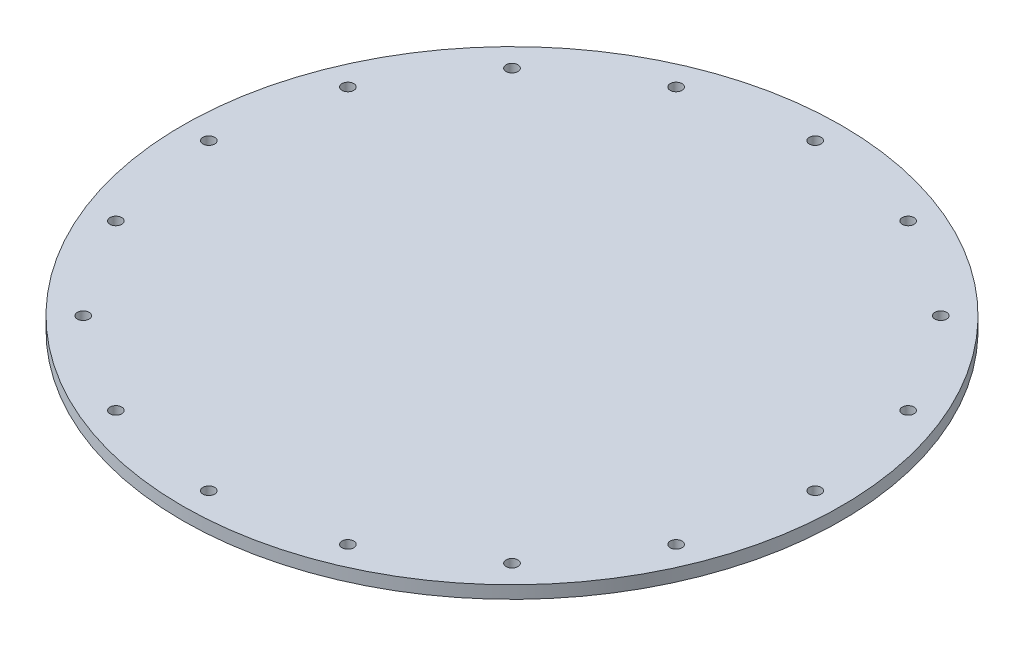
ISO-10303-21;
HEADER;
FILE_DESCRIPTION(('STEP AP214'),'2;1');
FILE_NAME('part.step','',(''),(''),'','','');
FILE_SCHEMA(('AUTOMOTIVE_DESIGN { 1 0 10303 214 1 1 1 1 }'));
ENDSEC;
DATA;
#1=APPLICATION_CONTEXT('core data for automotive mechanical design processes');
#2=APPLICATION_PROTOCOL_DEFINITION('international standard','automotive_design',2000,#1);
#3=PRODUCT_CONTEXT('',#1,'mechanical');
#4=PRODUCT('Part','Part','',(#3));
#5=PRODUCT_RELATED_PRODUCT_CATEGORY('part','',(#4));
#6=PRODUCT_DEFINITION_FORMATION('','',#4);
#7=PRODUCT_DEFINITION_CONTEXT('part definition',#1,'design');
#8=PRODUCT_DEFINITION('design','',#6,#7);
#9=PRODUCT_DEFINITION_SHAPE('','',#8);
#10=(LENGTH_UNIT() NAMED_UNIT(*) SI_UNIT(.MILLI.,.METRE.));
#11=(NAMED_UNIT(*) PLANE_ANGLE_UNIT() SI_UNIT($,.RADIAN.));
#12=(NAMED_UNIT(*) SI_UNIT($,.STERADIAN.) SOLID_ANGLE_UNIT());
#13=UNCERTAINTY_MEASURE_WITH_UNIT(LENGTH_MEASURE(1.E-05),#10,'distance_accuracy_value','');
#14=(GEOMETRIC_REPRESENTATION_CONTEXT(3) GLOBAL_UNCERTAINTY_ASSIGNED_CONTEXT((#13)) GLOBAL_UNIT_ASSIGNED_CONTEXT((#10,
#11,#12)) REPRESENTATION_CONTEXT('',''));
#15=CARTESIAN_POINT('',(0.,0.,0.));
#16=DIRECTION('',(0.,0.,1.));
#17=DIRECTION('',(1.,0.,0.));
#18=AXIS2_PLACEMENT_3D('',#15,#16,#17);
#19=CARTESIAN_POINT('',(0.,3.048,0.));
#20=DIRECTION('',(0.,1.,0.));
#21=DIRECTION('',(0.,0.,1.));
#22=AXIS2_PLACEMENT_3D('',#19,#20,#21);
#23=PLANE('',#22);
#24=CARTESIAN_POINT('',(-51.6364726961476,3.048,-51.6364726961476));
#25=DIRECTION('',(0.,1.,0.));
#26=DIRECTION('',(0.,0.,1.));
#27=AXIS2_PLACEMENT_3D('',#24,#25,#26);
#28=CIRCLE('',#27,1.42240000000086);
#29=CARTESIAN_POINT('',(-51.6364726961476,3.048,-50.2140726961468));
#30=VERTEX_POINT('',#29);
#31=EDGE_CURVE('E124',#30,#30,#28,.T.);
#32=ORIENTED_EDGE('',*,*,#31,.F.);
#33=EDGE_LOOP('',(#32));
#34=FACE_BOUND('',#33,.T.);
#35=CARTESIAN_POINT('',(-73.025,3.048,0.));
#36=DIRECTION('',(0.,1.,0.));
#37=DIRECTION('',(0.,0.,1.));
#38=AXIS2_PLACEMENT_3D('',#35,#36,#37);
#39=CIRCLE('',#38,1.42240000000075);
#40=CARTESIAN_POINT('',(-73.025,3.048,1.42240000000076));
#41=VERTEX_POINT('',#40);
#42=EDGE_CURVE('E112',#41,#41,#39,.T.);
#43=ORIENTED_EDGE('',*,*,#42,.F.);
#44=EDGE_LOOP('',(#43));
#45=FACE_BOUND('',#44,.T.);
#46=CARTESIAN_POINT('',(-51.6364726961476,3.048,51.6364726961476));
#47=DIRECTION('',(0.,1.,0.));
#48=DIRECTION('',(0.,0.,1.));
#49=AXIS2_PLACEMENT_3D('',#46,#47,#48);
#50=CIRCLE('',#49,1.42240000000064);
#51=CARTESIAN_POINT('',(-51.6364726961476,3.048,53.0588726961483));
#52=VERTEX_POINT('',#51);
#53=EDGE_CURVE('E100',#52,#52,#50,.T.);
#54=ORIENTED_EDGE('',*,*,#53,.F.);
#55=EDGE_LOOP('',(#54));
#56=FACE_BOUND('',#55,.T.);
#57=CARTESIAN_POINT('',(0.,3.048,73.025));
#58=DIRECTION('',(0.,1.,0.));
#59=DIRECTION('',(0.,0.,1.));
#60=AXIS2_PLACEMENT_3D('',#57,#58,#59);
#61=CIRCLE('',#60,1.4224000000005);
#62=CARTESIAN_POINT('',(0.,3.048,74.4474000000005));
#63=VERTEX_POINT('',#62);
#64=EDGE_CURVE('E88',#63,#63,#61,.T.);
#65=ORIENTED_EDGE('',*,*,#64,.F.);
#66=EDGE_LOOP('',(#65));
#67=FACE_BOUND('',#66,.T.);
#68=CARTESIAN_POINT('',(51.6364726961476,3.048,51.6364726961476));
#69=DIRECTION('',(0.,1.,0.));
#70=DIRECTION('',(0.,0.,1.));
#71=AXIS2_PLACEMENT_3D('',#68,#69,#70);
#72=CIRCLE('',#71,1.42240000000036);
#73=CARTESIAN_POINT('',(51.6364726961476,3.048,53.058872696148));
#74=VERTEX_POINT('',#73);
#75=EDGE_CURVE('E76',#74,#74,#72,.T.);
#76=ORIENTED_EDGE('',*,*,#75,.F.);
#77=EDGE_LOOP('',(#76));
#78=FACE_BOUND('',#77,.T.);
#79=CARTESIAN_POINT('',(73.025,3.048,0.));
#80=DIRECTION('',(0.,1.,0.));
#81=DIRECTION('',(0.,0.,1.));
#82=AXIS2_PLACEMENT_3D('',#79,#80,#81);
#83=CIRCLE('',#82,1.42240000000026);
#84=CARTESIAN_POINT('',(73.025,3.048,1.42240000000025));
#85=VERTEX_POINT('',#84);
#86=EDGE_CURVE('E64',#85,#85,#83,.T.);
#87=ORIENTED_EDGE('',*,*,#86,.F.);
#88=EDGE_LOOP('',(#87));
#89=FACE_BOUND('',#88,.T.);
#90=CARTESIAN_POINT('',(51.6364726961476,3.048,-51.6364726961476));
#91=DIRECTION('',(0.,1.,0.));
#92=DIRECTION('',(0.,0.,1.));
#93=AXIS2_PLACEMENT_3D('',#90,#91,#92);
#94=CIRCLE('',#93,1.42240000000012);
#95=CARTESIAN_POINT('',(51.6364726961476,3.048,-50.2140726961475));
#96=VERTEX_POINT('',#95);
#97=EDGE_CURVE('E52',#96,#96,#94,.T.);
#98=ORIENTED_EDGE('',*,*,#97,.F.);
#99=EDGE_LOOP('',(#98));
#100=FACE_BOUND('',#99,.T.);
#101=CARTESIAN_POINT('',(0.,3.048,-73.025));
#102=DIRECTION('',(0.,1.,0.));
#103=DIRECTION('',(0.,0.,1.));
#104=AXIS2_PLACEMENT_3D('',#101,#102,#103);
#105=CIRCLE('',#104,1.4224);
#106=CARTESIAN_POINT('',(0.,3.048,-71.6026));
#107=VERTEX_POINT('',#106);
#108=EDGE_CURVE('E41',#107,#107,#105,.T.);
#109=ORIENTED_EDGE('',*,*,#108,.F.);
#110=EDGE_LOOP('',(#109));
#111=FACE_BOUND('',#110,.T.);
#112=CARTESIAN_POINT('',(0.,3.048,0.));
#113=DIRECTION('',(0.,1.,0.));
#114=DIRECTION('',(0.,0.,1.));
#115=AXIS2_PLACEMENT_3D('',#112,#113,#114);
#116=CIRCLE('',#115,79.375);
#117=CARTESIAN_POINT('',(0.,3.048,79.375));
#118=VERTEX_POINT('',#117);
#119=EDGE_CURVE('E10',#118,#118,#116,.T.);
#120=ORIENTED_EDGE('',*,*,#119,.T.);
#121=EDGE_LOOP('',(#120));
#122=FACE_BOUND('',#121,.T.);
#123=CARTESIAN_POINT('',(27.9454576484607,3.048,-67.4663028616367));
#124=DIRECTION('',(0.,1.,0.));
#125=DIRECTION('',(0.,0.,1.));
#126=AXIS2_PLACEMENT_3D('',#123,#124,#125);
#127=CIRCLE('',#126,1.42240000000009);
#128=CARTESIAN_POINT('',(27.9454576484607,3.048,-66.0439028616366));
#129=VERTEX_POINT('',#128);
#130=EDGE_CURVE('E46',#129,#129,#127,.T.);
#131=ORIENTED_EDGE('',*,*,#130,.F.);
#132=EDGE_LOOP('',(#131));
#133=FACE_BOUND('',#132,.T.);
#134=CARTESIAN_POINT('',(67.4663028616367,3.048,-27.9454576484607));
#135=DIRECTION('',(0.,1.,0.));
#136=DIRECTION('',(0.,0.,1.));
#137=AXIS2_PLACEMENT_3D('',#134,#135,#136);
#138=CIRCLE('',#137,1.42240000000019);
#139=CARTESIAN_POINT('',(67.4663028616367,3.048,-26.5230576484605));
#140=VERTEX_POINT('',#139);
#141=EDGE_CURVE('E58',#140,#140,#138,.T.);
#142=ORIENTED_EDGE('',*,*,#141,.F.);
#143=EDGE_LOOP('',(#142));
#144=FACE_BOUND('',#143,.T.);
#145=CARTESIAN_POINT('',(67.4663028616367,3.048,27.9454576484607));
#146=DIRECTION('',(0.,1.,0.));
#147=DIRECTION('',(0.,0.,1.));
#148=AXIS2_PLACEMENT_3D('',#145,#146,#147);
#149=CIRCLE('',#148,1.42240000000032);
#150=CARTESIAN_POINT('',(67.4663028616367,3.048,29.367857648461));
#151=VERTEX_POINT('',#150);
#152=EDGE_CURVE('E70',#151,#151,#149,.T.);
#153=ORIENTED_EDGE('',*,*,#152,.F.);
#154=EDGE_LOOP('',(#153));
#155=FACE_BOUND('',#154,.T.);
#156=CARTESIAN_POINT('',(27.9454576484607,3.048,67.4663028616367));
#157=DIRECTION('',(0.,1.,0.));
#158=DIRECTION('',(0.,0.,1.));
#159=AXIS2_PLACEMENT_3D('',#156,#157,#158);
#160=CIRCLE('',#159,1.42240000000043);
#161=CARTESIAN_POINT('',(27.9454576484607,3.048,68.8887028616371));
#162=VERTEX_POINT('',#161);
#163=EDGE_CURVE('E82',#162,#162,#160,.T.);
#164=ORIENTED_EDGE('',*,*,#163,.F.);
#165=EDGE_LOOP('',(#164));
#166=FACE_BOUND('',#165,.T.);
#167=CARTESIAN_POINT('',(-27.9454576484607,3.048,67.4663028616367));
#168=DIRECTION('',(0.,1.,0.));
#169=DIRECTION('',(0.,0.,1.));
#170=AXIS2_PLACEMENT_3D('',#167,#168,#169);
#171=CIRCLE('',#170,1.42240000000055);
#172=CARTESIAN_POINT('',(-27.9454576484607,3.048,68.8887028616373));
#173=VERTEX_POINT('',#172);
#174=EDGE_CURVE('E94',#173,#173,#171,.T.);
#175=ORIENTED_EDGE('',*,*,#174,.F.);
#176=EDGE_LOOP('',(#175));
#177=FACE_BOUND('',#176,.T.);
#178=CARTESIAN_POINT('',(-67.4663028616367,3.048,27.9454576484607));
#179=DIRECTION('',(0.,1.,0.));
#180=DIRECTION('',(0.,0.,1.));
#181=AXIS2_PLACEMENT_3D('',#178,#179,#180);
#182=CIRCLE('',#181,1.42240000000075);
#183=CARTESIAN_POINT('',(-67.4663028616367,3.048,29.3678576484615));
#184=VERTEX_POINT('',#183);
#185=EDGE_CURVE('E106',#184,#184,#182,.T.);
#186=ORIENTED_EDGE('',*,*,#185,.F.);
#187=EDGE_LOOP('',(#186));
#188=FACE_BOUND('',#187,.T.);
#189=CARTESIAN_POINT('',(-67.4663028616367,3.048,-27.9454576484607));
#190=DIRECTION('',(0.,1.,0.));
#191=DIRECTION('',(0.,0.,1.));
#192=AXIS2_PLACEMENT_3D('',#189,#190,#191);
#193=CIRCLE('',#192,1.42240000000075);
#194=CARTESIAN_POINT('',(-67.4663028616367,3.048,-26.5230576484599));
#195=VERTEX_POINT('',#194);
#196=EDGE_CURVE('E118',#195,#195,#193,.T.);
#197=ORIENTED_EDGE('',*,*,#196,.F.);
#198=EDGE_LOOP('',(#197));
#199=FACE_BOUND('',#198,.T.);
#200=CARTESIAN_POINT('',(-27.9454576484607,3.048,-67.4663028616367));
#201=DIRECTION('',(0.,1.,0.));
#202=DIRECTION('',(0.,0.,1.));
#203=AXIS2_PLACEMENT_3D('',#200,#201,#202);
#204=CIRCLE('',#203,1.42240000000098);
#205=CARTESIAN_POINT('',(-27.9454576484607,3.048,-66.0439028616357));
#206=VERTEX_POINT('',#205);
#207=EDGE_CURVE('E130',#206,#206,#204,.T.);
#208=ORIENTED_EDGE('',*,*,#207,.F.);
#209=EDGE_LOOP('',(#208));
#210=FACE_BOUND('',#209,.T.);
#211=ADVANCED_FACE('F30',(#34,#45,#56,#67,#78,#89,#100,#111,#122,#133,#144,#155,#166,#177,#188,
#199,#210),#23,.T.);
#212=CARTESIAN_POINT('',(0.,0.,0.));
#213=DIRECTION('',(0.,1.,0.));
#214=DIRECTION('',(0.,0.,1.));
#215=AXIS2_PLACEMENT_3D('',#212,#213,#214);
#216=PLANE('',#215);
#217=CARTESIAN_POINT('',(-51.6364726961476,0.,-51.6364726961476));
#218=DIRECTION('',(0.,1.,0.));
#219=DIRECTION('',(0.,0.,1.));
#220=AXIS2_PLACEMENT_3D('',#217,#218,#219);
#221=CIRCLE('',#220,1.42240000000086);
#222=CARTESIAN_POINT('',(-51.6364726961476,0.,-50.2140726961468));
#223=VERTEX_POINT('',#222);
#224=EDGE_CURVE('E127',#223,#223,#221,.T.);
#225=ORIENTED_EDGE('',*,*,#224,.T.);
#226=EDGE_LOOP('',(#225));
#227=FACE_BOUND('',#226,.T.);
#228=CARTESIAN_POINT('',(-73.025,0.,0.));
#229=DIRECTION('',(0.,1.,0.));
#230=DIRECTION('',(0.,0.,1.));
#231=AXIS2_PLACEMENT_3D('',#228,#229,#230);
#232=CIRCLE('',#231,1.42240000000075);
#233=CARTESIAN_POINT('',(-73.025,0.,1.42240000000076));
#234=VERTEX_POINT('',#233);
#235=EDGE_CURVE('E115',#234,#234,#232,.T.);
#236=ORIENTED_EDGE('',*,*,#235,.T.);
#237=EDGE_LOOP('',(#236));
#238=FACE_BOUND('',#237,.T.);
#239=CARTESIAN_POINT('',(-51.6364726961476,0.,51.6364726961476));
#240=DIRECTION('',(0.,1.,0.));
#241=DIRECTION('',(0.,0.,1.));
#242=AXIS2_PLACEMENT_3D('',#239,#240,#241);
#243=CIRCLE('',#242,1.42240000000064);
#244=CARTESIAN_POINT('',(-51.6364726961476,0.,53.0588726961483));
#245=VERTEX_POINT('',#244);
#246=EDGE_CURVE('E103',#245,#245,#243,.T.);
#247=ORIENTED_EDGE('',*,*,#246,.T.);
#248=EDGE_LOOP('',(#247));
#249=FACE_BOUND('',#248,.T.);
#250=CARTESIAN_POINT('',(0.,0.,73.025));
#251=DIRECTION('',(0.,1.,0.));
#252=DIRECTION('',(0.,0.,1.));
#253=AXIS2_PLACEMENT_3D('',#250,#251,#252);
#254=CIRCLE('',#253,1.4224000000005);
#255=CARTESIAN_POINT('',(0.,0.,74.4474000000005));
#256=VERTEX_POINT('',#255);
#257=EDGE_CURVE('E91',#256,#256,#254,.T.);
#258=ORIENTED_EDGE('',*,*,#257,.T.);
#259=EDGE_LOOP('',(#258));
#260=FACE_BOUND('',#259,.T.);
#261=CARTESIAN_POINT('',(51.6364726961476,0.,51.6364726961476));
#262=DIRECTION('',(0.,1.,0.));
#263=DIRECTION('',(0.,0.,1.));
#264=AXIS2_PLACEMENT_3D('',#261,#262,#263);
#265=CIRCLE('',#264,1.42240000000036);
#266=CARTESIAN_POINT('',(51.6364726961476,0.,53.058872696148));
#267=VERTEX_POINT('',#266);
#268=EDGE_CURVE('E79',#267,#267,#265,.T.);
#269=ORIENTED_EDGE('',*,*,#268,.T.);
#270=EDGE_LOOP('',(#269));
#271=FACE_BOUND('',#270,.T.);
#272=CARTESIAN_POINT('',(73.025,0.,0.));
#273=DIRECTION('',(0.,1.,0.));
#274=DIRECTION('',(0.,0.,1.));
#275=AXIS2_PLACEMENT_3D('',#272,#273,#274);
#276=CIRCLE('',#275,1.42240000000026);
#277=CARTESIAN_POINT('',(73.025,0.,1.42240000000025));
#278=VERTEX_POINT('',#277);
#279=EDGE_CURVE('E67',#278,#278,#276,.T.);
#280=ORIENTED_EDGE('',*,*,#279,.T.);
#281=EDGE_LOOP('',(#280));
#282=FACE_BOUND('',#281,.T.);
#283=CARTESIAN_POINT('',(51.6364726961476,0.,-51.6364726961476));
#284=DIRECTION('',(0.,1.,0.));
#285=DIRECTION('',(0.,0.,1.));
#286=AXIS2_PLACEMENT_3D('',#283,#284,#285);
#287=CIRCLE('',#286,1.42240000000012);
#288=CARTESIAN_POINT('',(51.6364726961476,0.,-50.2140726961475));
#289=VERTEX_POINT('',#288);
#290=EDGE_CURVE('E55',#289,#289,#287,.T.);
#291=ORIENTED_EDGE('',*,*,#290,.T.);
#292=EDGE_LOOP('',(#291));
#293=FACE_BOUND('',#292,.T.);
#294=CARTESIAN_POINT('',(0.,0.,-73.025));
#295=DIRECTION('',(0.,1.,0.));
#296=DIRECTION('',(0.,0.,1.));
#297=AXIS2_PLACEMENT_3D('',#294,#295,#296);
#298=CIRCLE('',#297,1.4224);
#299=CARTESIAN_POINT('',(0.,0.,-71.6026));
#300=VERTEX_POINT('',#299);
#301=EDGE_CURVE('E43',#300,#300,#298,.T.);
#302=ORIENTED_EDGE('',*,*,#301,.T.);
#303=EDGE_LOOP('',(#302));
#304=FACE_BOUND('',#303,.T.);
#305=CARTESIAN_POINT('',(0.,0.,0.));
#306=DIRECTION('',(0.,1.,0.));
#307=DIRECTION('',(0.,0.,1.));
#308=AXIS2_PLACEMENT_3D('',#305,#306,#307);
#309=CIRCLE('',#308,79.375);
#310=CARTESIAN_POINT('',(0.,0.,79.375));
#311=VERTEX_POINT('',#310);
#312=EDGE_CURVE('E34',#311,#311,#309,.T.);
#313=ORIENTED_EDGE('',*,*,#312,.F.);
#314=EDGE_LOOP('',(#313));
#315=FACE_BOUND('',#314,.T.);
#316=CARTESIAN_POINT('',(27.9454576484607,0.,-67.4663028616367));
#317=DIRECTION('',(0.,1.,0.));
#318=DIRECTION('',(0.,0.,1.));
#319=AXIS2_PLACEMENT_3D('',#316,#317,#318);
#320=CIRCLE('',#319,1.42240000000009);
#321=CARTESIAN_POINT('',(27.9454576484607,0.,-66.0439028616366));
#322=VERTEX_POINT('',#321);
#323=EDGE_CURVE('E49',#322,#322,#320,.T.);
#324=ORIENTED_EDGE('',*,*,#323,.T.);
#325=EDGE_LOOP('',(#324));
#326=FACE_BOUND('',#325,.T.);
#327=CARTESIAN_POINT('',(67.4663028616367,0.,-27.9454576484607));
#328=DIRECTION('',(0.,1.,0.));
#329=DIRECTION('',(0.,0.,1.));
#330=AXIS2_PLACEMENT_3D('',#327,#328,#329);
#331=CIRCLE('',#330,1.42240000000019);
#332=CARTESIAN_POINT('',(67.4663028616367,0.,-26.5230576484605));
#333=VERTEX_POINT('',#332);
#334=EDGE_CURVE('E61',#333,#333,#331,.T.);
#335=ORIENTED_EDGE('',*,*,#334,.T.);
#336=EDGE_LOOP('',(#335));
#337=FACE_BOUND('',#336,.T.);
#338=CARTESIAN_POINT('',(67.4663028616367,0.,27.9454576484607));
#339=DIRECTION('',(0.,1.,0.));
#340=DIRECTION('',(0.,0.,1.));
#341=AXIS2_PLACEMENT_3D('',#338,#339,#340);
#342=CIRCLE('',#341,1.42240000000032);
#343=CARTESIAN_POINT('',(67.4663028616367,0.,29.367857648461));
#344=VERTEX_POINT('',#343);
#345=EDGE_CURVE('E73',#344,#344,#342,.T.);
#346=ORIENTED_EDGE('',*,*,#345,.T.);
#347=EDGE_LOOP('',(#346));
#348=FACE_BOUND('',#347,.T.);
#349=CARTESIAN_POINT('',(27.9454576484607,0.,67.4663028616367));
#350=DIRECTION('',(0.,1.,0.));
#351=DIRECTION('',(0.,0.,1.));
#352=AXIS2_PLACEMENT_3D('',#349,#350,#351);
#353=CIRCLE('',#352,1.42240000000043);
#354=CARTESIAN_POINT('',(27.9454576484607,0.,68.8887028616371));
#355=VERTEX_POINT('',#354);
#356=EDGE_CURVE('E85',#355,#355,#353,.T.);
#357=ORIENTED_EDGE('',*,*,#356,.T.);
#358=EDGE_LOOP('',(#357));
#359=FACE_BOUND('',#358,.T.);
#360=CARTESIAN_POINT('',(-27.9454576484607,0.,67.4663028616367));
#361=DIRECTION('',(0.,1.,0.));
#362=DIRECTION('',(0.,0.,1.));
#363=AXIS2_PLACEMENT_3D('',#360,#361,#362);
#364=CIRCLE('',#363,1.42240000000055);
#365=CARTESIAN_POINT('',(-27.9454576484607,0.,68.8887028616373));
#366=VERTEX_POINT('',#365);
#367=EDGE_CURVE('E97',#366,#366,#364,.T.);
#368=ORIENTED_EDGE('',*,*,#367,.T.);
#369=EDGE_LOOP('',(#368));
#370=FACE_BOUND('',#369,.T.);
#371=CARTESIAN_POINT('',(-67.4663028616367,0.,27.9454576484607));
#372=DIRECTION('',(0.,1.,0.));
#373=DIRECTION('',(0.,0.,1.));
#374=AXIS2_PLACEMENT_3D('',#371,#372,#373);
#375=CIRCLE('',#374,1.42240000000075);
#376=CARTESIAN_POINT('',(-67.4663028616367,0.,29.3678576484615));
#377=VERTEX_POINT('',#376);
#378=EDGE_CURVE('E109',#377,#377,#375,.T.);
#379=ORIENTED_EDGE('',*,*,#378,.T.);
#380=EDGE_LOOP('',(#379));
#381=FACE_BOUND('',#380,.T.);
#382=CARTESIAN_POINT('',(-67.4663028616367,0.,-27.9454576484607));
#383=DIRECTION('',(0.,1.,0.));
#384=DIRECTION('',(0.,0.,1.));
#385=AXIS2_PLACEMENT_3D('',#382,#383,#384);
#386=CIRCLE('',#385,1.42240000000075);
#387=CARTESIAN_POINT('',(-67.4663028616367,0.,-26.5230576484599));
#388=VERTEX_POINT('',#387);
#389=EDGE_CURVE('E121',#388,#388,#386,.T.);
#390=ORIENTED_EDGE('',*,*,#389,.T.);
#391=EDGE_LOOP('',(#390));
#392=FACE_BOUND('',#391,.T.);
#393=CARTESIAN_POINT('',(-27.9454576484607,0.,-67.4663028616367));
#394=DIRECTION('',(0.,1.,0.));
#395=DIRECTION('',(0.,0.,1.));
#396=AXIS2_PLACEMENT_3D('',#393,#394,#395);
#397=CIRCLE('',#396,1.42240000000098);
#398=CARTESIAN_POINT('',(-27.9454576484607,0.,-66.0439028616357));
#399=VERTEX_POINT('',#398);
#400=EDGE_CURVE('E133',#399,#399,#397,.T.);
#401=ORIENTED_EDGE('',*,*,#400,.T.);
#402=EDGE_LOOP('',(#401));
#403=FACE_BOUND('',#402,.T.);
#404=ADVANCED_FACE('F143',(#227,#238,#249,#260,#271,#282,#293,#304,#315,#326,#337,#348,#359,
#370,#381,#392,#403),#216,.F.);
#405=CARTESIAN_POINT('',(0.,3.048,0.));
#406=DIRECTION('',(0.,-1.,0.));
#407=DIRECTION('',(0.,0.,-1.));
#408=AXIS2_PLACEMENT_3D('',#405,#406,#407);
#409=CYLINDRICAL_SURFACE('',#408,79.375);
#410=ORIENTED_EDGE('',*,*,#119,.F.);
#411=EDGE_LOOP('',(#410));
#412=FACE_BOUND('',#411,.T.);
#413=ORIENTED_EDGE('',*,*,#312,.T.);
#414=EDGE_LOOP('',(#413));
#415=FACE_BOUND('',#414,.T.);
#416=ADVANCED_FACE('F32',(#412,#415),#409,.T.);
#417=CARTESIAN_POINT('',(0.,3.048,-73.025));
#418=DIRECTION('',(0.,-1.,0.));
#419=DIRECTION('',(0.,0.,-1.));
#420=AXIS2_PLACEMENT_3D('',#417,#418,#419);
#421=CYLINDRICAL_SURFACE('',#420,1.4224);
#422=ORIENTED_EDGE('',*,*,#108,.T.);
#423=EDGE_LOOP('',(#422));
#424=FACE_BOUND('',#423,.T.);
#425=ORIENTED_EDGE('',*,*,#301,.F.);
#426=EDGE_LOOP('',(#425));
#427=FACE_BOUND('',#426,.T.);
#428=ADVANCED_FACE('F153',(#424,#427),#421,.F.);
#429=CARTESIAN_POINT('',(27.9454576484607,3.048,-67.4663028616367));
#430=DIRECTION('',(0.,-1.,0.));
#431=DIRECTION('',(0.,0.,-1.));
#432=AXIS2_PLACEMENT_3D('',#429,#430,#431);
#433=CYLINDRICAL_SURFACE('',#432,1.42240000000009);
#434=ORIENTED_EDGE('',*,*,#130,.T.);
#435=EDGE_LOOP('',(#434));
#436=FACE_BOUND('',#435,.T.);
#437=ORIENTED_EDGE('',*,*,#323,.F.);
#438=EDGE_LOOP('',(#437));
#439=FACE_BOUND('',#438,.T.);
#440=ADVANCED_FACE('F156',(#436,#439),#433,.F.);
#441=CARTESIAN_POINT('',(51.6364726961476,3.048,-51.6364726961476));
#442=DIRECTION('',(0.,-1.,0.));
#443=DIRECTION('',(0.,0.,-1.));
#444=AXIS2_PLACEMENT_3D('',#441,#442,#443);
#445=CYLINDRICAL_SURFACE('',#444,1.42240000000012);
#446=ORIENTED_EDGE('',*,*,#97,.T.);
#447=EDGE_LOOP('',(#446));
#448=FACE_BOUND('',#447,.T.);
#449=ORIENTED_EDGE('',*,*,#290,.F.);
#450=EDGE_LOOP('',(#449));
#451=FACE_BOUND('',#450,.T.);
#452=ADVANCED_FACE('F160',(#448,#451),#445,.F.);
#453=CARTESIAN_POINT('',(67.4663028616367,3.048,-27.9454576484607));
#454=DIRECTION('',(0.,-1.,0.));
#455=DIRECTION('',(0.,0.,-1.));
#456=AXIS2_PLACEMENT_3D('',#453,#454,#455);
#457=CYLINDRICAL_SURFACE('',#456,1.42240000000019);
#458=ORIENTED_EDGE('',*,*,#141,.T.);
#459=EDGE_LOOP('',(#458));
#460=FACE_BOUND('',#459,.T.);
#461=ORIENTED_EDGE('',*,*,#334,.F.);
#462=EDGE_LOOP('',(#461));
#463=FACE_BOUND('',#462,.T.);
#464=ADVANCED_FACE('F164',(#460,#463),#457,.F.);
#465=CARTESIAN_POINT('',(73.025,3.048,0.));
#466=DIRECTION('',(0.,-1.,0.));
#467=DIRECTION('',(0.,0.,-1.));
#468=AXIS2_PLACEMENT_3D('',#465,#466,#467);
#469=CYLINDRICAL_SURFACE('',#468,1.42240000000026);
#470=ORIENTED_EDGE('',*,*,#86,.T.);
#471=EDGE_LOOP('',(#470));
#472=FACE_BOUND('',#471,.T.);
#473=ORIENTED_EDGE('',*,*,#279,.F.);
#474=EDGE_LOOP('',(#473));
#475=FACE_BOUND('',#474,.T.);
#476=ADVANCED_FACE('F168',(#472,#475),#469,.F.);
#477=CARTESIAN_POINT('',(67.4663028616367,3.048,27.9454576484607));
#478=DIRECTION('',(0.,-1.,0.));
#479=DIRECTION('',(0.,0.,-1.));
#480=AXIS2_PLACEMENT_3D('',#477,#478,#479);
#481=CYLINDRICAL_SURFACE('',#480,1.42240000000032);
#482=ORIENTED_EDGE('',*,*,#152,.T.);
#483=EDGE_LOOP('',(#482));
#484=FACE_BOUND('',#483,.T.);
#485=ORIENTED_EDGE('',*,*,#345,.F.);
#486=EDGE_LOOP('',(#485));
#487=FACE_BOUND('',#486,.T.);
#488=ADVANCED_FACE('F172',(#484,#487),#481,.F.);
#489=CARTESIAN_POINT('',(51.6364726961476,3.048,51.6364726961476));
#490=DIRECTION('',(0.,-1.,0.));
#491=DIRECTION('',(0.,0.,-1.));
#492=AXIS2_PLACEMENT_3D('',#489,#490,#491);
#493=CYLINDRICAL_SURFACE('',#492,1.42240000000036);
#494=ORIENTED_EDGE('',*,*,#75,.T.);
#495=EDGE_LOOP('',(#494));
#496=FACE_BOUND('',#495,.T.);
#497=ORIENTED_EDGE('',*,*,#268,.F.);
#498=EDGE_LOOP('',(#497));
#499=FACE_BOUND('',#498,.T.);
#500=ADVANCED_FACE('F176',(#496,#499),#493,.F.);
#501=CARTESIAN_POINT('',(27.9454576484607,3.048,67.4663028616367));
#502=DIRECTION('',(0.,-1.,0.));
#503=DIRECTION('',(0.,0.,-1.));
#504=AXIS2_PLACEMENT_3D('',#501,#502,#503);
#505=CYLINDRICAL_SURFACE('',#504,1.42240000000043);
#506=ORIENTED_EDGE('',*,*,#163,.T.);
#507=EDGE_LOOP('',(#506));
#508=FACE_BOUND('',#507,.T.);
#509=ORIENTED_EDGE('',*,*,#356,.F.);
#510=EDGE_LOOP('',(#509));
#511=FACE_BOUND('',#510,.T.);
#512=ADVANCED_FACE('F180',(#508,#511),#505,.F.);
#513=CARTESIAN_POINT('',(0.,3.048,73.025));
#514=DIRECTION('',(0.,-1.,0.));
#515=DIRECTION('',(0.,0.,-1.));
#516=AXIS2_PLACEMENT_3D('',#513,#514,#515);
#517=CYLINDRICAL_SURFACE('',#516,1.4224000000005);
#518=ORIENTED_EDGE('',*,*,#64,.T.);
#519=EDGE_LOOP('',(#518));
#520=FACE_BOUND('',#519,.T.);
#521=ORIENTED_EDGE('',*,*,#257,.F.);
#522=EDGE_LOOP('',(#521));
#523=FACE_BOUND('',#522,.T.);
#524=ADVANCED_FACE('F184',(#520,#523),#517,.F.);
#525=CARTESIAN_POINT('',(-27.9454576484607,3.048,67.4663028616367));
#526=DIRECTION('',(0.,-1.,0.));
#527=DIRECTION('',(0.,0.,-1.));
#528=AXIS2_PLACEMENT_3D('',#525,#526,#527);
#529=CYLINDRICAL_SURFACE('',#528,1.42240000000055);
#530=ORIENTED_EDGE('',*,*,#174,.T.);
#531=EDGE_LOOP('',(#530));
#532=FACE_BOUND('',#531,.T.);
#533=ORIENTED_EDGE('',*,*,#367,.F.);
#534=EDGE_LOOP('',(#533));
#535=FACE_BOUND('',#534,.T.);
#536=ADVANCED_FACE('F188',(#532,#535),#529,.F.);
#537=CARTESIAN_POINT('',(-51.6364726961476,3.048,51.6364726961476));
#538=DIRECTION('',(0.,-1.,0.));
#539=DIRECTION('',(0.,0.,-1.));
#540=AXIS2_PLACEMENT_3D('',#537,#538,#539);
#541=CYLINDRICAL_SURFACE('',#540,1.42240000000064);
#542=ORIENTED_EDGE('',*,*,#53,.T.);
#543=EDGE_LOOP('',(#542));
#544=FACE_BOUND('',#543,.T.);
#545=ORIENTED_EDGE('',*,*,#246,.F.);
#546=EDGE_LOOP('',(#545));
#547=FACE_BOUND('',#546,.T.);
#548=ADVANCED_FACE('F192',(#544,#547),#541,.F.);
#549=CARTESIAN_POINT('',(-67.4663028616367,3.048,27.9454576484607));
#550=DIRECTION('',(0.,-1.,0.));
#551=DIRECTION('',(0.,0.,-1.));
#552=AXIS2_PLACEMENT_3D('',#549,#550,#551);
#553=CYLINDRICAL_SURFACE('',#552,1.42240000000075);
#554=ORIENTED_EDGE('',*,*,#185,.T.);
#555=EDGE_LOOP('',(#554));
#556=FACE_BOUND('',#555,.T.);
#557=ORIENTED_EDGE('',*,*,#378,.F.);
#558=EDGE_LOOP('',(#557));
#559=FACE_BOUND('',#558,.T.);
#560=ADVANCED_FACE('F196',(#556,#559),#553,.F.);
#561=CARTESIAN_POINT('',(-73.025,3.048,0.));
#562=DIRECTION('',(0.,-1.,0.));
#563=DIRECTION('',(0.,0.,-1.));
#564=AXIS2_PLACEMENT_3D('',#561,#562,#563);
#565=CYLINDRICAL_SURFACE('',#564,1.42240000000075);
#566=ORIENTED_EDGE('',*,*,#42,.T.);
#567=EDGE_LOOP('',(#566));
#568=FACE_BOUND('',#567,.T.);
#569=ORIENTED_EDGE('',*,*,#235,.F.);
#570=EDGE_LOOP('',(#569));
#571=FACE_BOUND('',#570,.T.);
#572=ADVANCED_FACE('F200',(#568,#571),#565,.F.);
#573=CARTESIAN_POINT('',(-67.4663028616367,3.048,-27.9454576484607));
#574=DIRECTION('',(0.,-1.,0.));
#575=DIRECTION('',(0.,0.,-1.));
#576=AXIS2_PLACEMENT_3D('',#573,#574,#575);
#577=CYLINDRICAL_SURFACE('',#576,1.42240000000075);
#578=ORIENTED_EDGE('',*,*,#196,.T.);
#579=EDGE_LOOP('',(#578));
#580=FACE_BOUND('',#579,.T.);
#581=ORIENTED_EDGE('',*,*,#389,.F.);
#582=EDGE_LOOP('',(#581));
#583=FACE_BOUND('',#582,.T.);
#584=ADVANCED_FACE('F204',(#580,#583),#577,.F.);
#585=CARTESIAN_POINT('',(-51.6364726961476,3.048,-51.6364726961476));
#586=DIRECTION('',(0.,-1.,0.));
#587=DIRECTION('',(0.,0.,-1.));
#588=AXIS2_PLACEMENT_3D('',#585,#586,#587);
#589=CYLINDRICAL_SURFACE('',#588,1.42240000000086);
#590=ORIENTED_EDGE('',*,*,#31,.T.);
#591=EDGE_LOOP('',(#590));
#592=FACE_BOUND('',#591,.T.);
#593=ORIENTED_EDGE('',*,*,#224,.F.);
#594=EDGE_LOOP('',(#593));
#595=FACE_BOUND('',#594,.T.);
#596=ADVANCED_FACE('F208',(#592,#595),#589,.F.);
#597=CARTESIAN_POINT('',(-27.9454576484607,3.048,-67.4663028616367));
#598=DIRECTION('',(0.,-1.,0.));
#599=DIRECTION('',(0.,0.,-1.));
#600=AXIS2_PLACEMENT_3D('',#597,#598,#599);
#601=CYLINDRICAL_SURFACE('',#600,1.42240000000098);
#602=ORIENTED_EDGE('',*,*,#207,.T.);
#603=EDGE_LOOP('',(#602));
#604=FACE_BOUND('',#603,.T.);
#605=ORIENTED_EDGE('',*,*,#400,.F.);
#606=EDGE_LOOP('',(#605));
#607=FACE_BOUND('',#606,.T.);
#608=ADVANCED_FACE('F139',(#604,#607),#601,.F.);
#609=CLOSED_SHELL('',(#211,#404,#416,#428,#440,#452,#464,#476,#488,#500,#512,#524,#536,#548,
#560,#572,#584,#596,#608));
#610=MANIFOLD_SOLID_BREP('B2',#609);
#611=ADVANCED_BREP_SHAPE_REPRESENTATION('',(#18,#610),#14);
#612=SHAPE_DEFINITION_REPRESENTATION(#9,#611);
ENDSEC;
END-ISO-10303-21;
